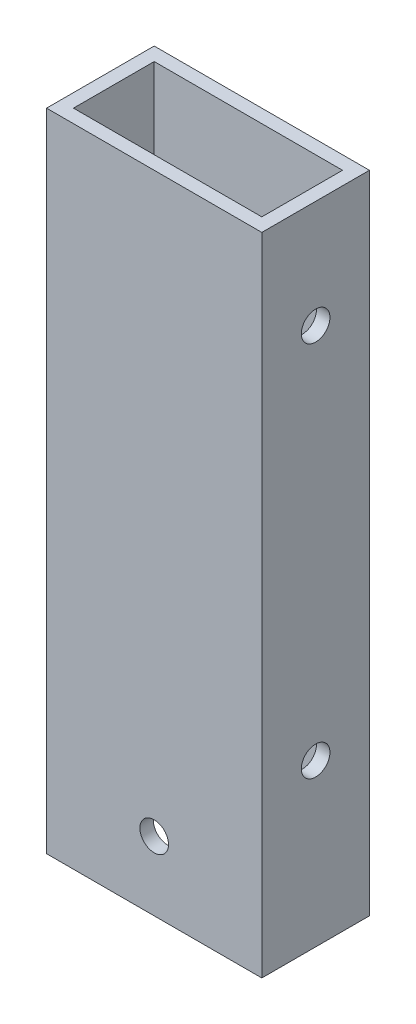
ISO-10303-21;
HEADER;
FILE_DESCRIPTION(('STEP AP214'),'2;1');
FILE_NAME('part.step','',(''),(''),'','','');
FILE_SCHEMA(('AUTOMOTIVE_DESIGN { 1 0 10303 214 1 1 1 1 }'));
ENDSEC;
DATA;
#1=APPLICATION_CONTEXT('core data for automotive mechanical design processes');
#2=APPLICATION_PROTOCOL_DEFINITION('international standard','automotive_design',2000,#1);
#3=PRODUCT_CONTEXT('',#1,'mechanical');
#4=PRODUCT('Part','Part','',(#3));
#5=PRODUCT_RELATED_PRODUCT_CATEGORY('part','',(#4));
#6=PRODUCT_DEFINITION_FORMATION('','',#4);
#7=PRODUCT_DEFINITION_CONTEXT('part definition',#1,'design');
#8=PRODUCT_DEFINITION('design','',#6,#7);
#9=PRODUCT_DEFINITION_SHAPE('','',#8);
#10=(LENGTH_UNIT() NAMED_UNIT(*) SI_UNIT(.MILLI.,.METRE.));
#11=(NAMED_UNIT(*) PLANE_ANGLE_UNIT() SI_UNIT($,.RADIAN.));
#12=(NAMED_UNIT(*) SI_UNIT($,.STERADIAN.) SOLID_ANGLE_UNIT());
#13=UNCERTAINTY_MEASURE_WITH_UNIT(LENGTH_MEASURE(1.E-05),#10,'distance_accuracy_value','');
#14=(GEOMETRIC_REPRESENTATION_CONTEXT(3) GLOBAL_UNCERTAINTY_ASSIGNED_CONTEXT((#13)) GLOBAL_UNIT_ASSIGNED_CONTEXT((#10,
#11,#12)) REPRESENTATION_CONTEXT('',''));
#15=CARTESIAN_POINT('',(0.,0.,0.));
#16=DIRECTION('',(0.,0.,1.));
#17=DIRECTION('',(1.,0.,0.));
#18=AXIS2_PLACEMENT_3D('',#15,#16,#17);
#19=CARTESIAN_POINT('',(0.,152.4,0.));
#20=DIRECTION('',(0.,-1.,0.));
#21=DIRECTION('',(0.,0.,-1.));
#22=AXIS2_PLACEMENT_3D('',#19,#20,#21);
#23=PLANE('',#22);
#24=DIRECTION('',(0.,0.,1.));
#25=VECTOR('',#24,1.);
#26=CARTESIAN_POINT('',(0.,152.4,0.));
#27=LINE('',#26,#25);
#28=CARTESIAN_POINT('',(0.,152.4,-25.4));
#29=VERTEX_POINT('',#28);
#30=CARTESIAN_POINT('',(0.,152.4,0.));
#31=VERTEX_POINT('',#30);
#32=EDGE_CURVE('E137',#29,#31,#27,.T.);
#33=ORIENTED_EDGE('',*,*,#32,.T.);
#34=DIRECTION('',(1.,0.,0.));
#35=VECTOR('',#34,1.);
#36=CARTESIAN_POINT('',(0.,152.4,0.));
#37=LINE('',#36,#35);
#38=CARTESIAN_POINT('',(50.8,152.4,0.));
#39=VERTEX_POINT('',#38);
#40=EDGE_CURVE('E140',#31,#39,#37,.T.);
#41=ORIENTED_EDGE('',*,*,#40,.T.);
#42=DIRECTION('',(0.,0.,-1.));
#43=VECTOR('',#42,1.);
#44=CARTESIAN_POINT('',(50.8,152.4,0.));
#45=LINE('',#44,#43);
#46=CARTESIAN_POINT('',(50.8,152.4,-25.4));
#47=VERTEX_POINT('',#46);
#48=EDGE_CURVE('E143',#39,#47,#45,.T.);
#49=ORIENTED_EDGE('',*,*,#48,.T.);
#50=DIRECTION('',(-1.,0.,0.));
#51=VECTOR('',#50,1.);
#52=CARTESIAN_POINT('',(0.,152.4,-25.4));
#53=LINE('',#52,#51);
#54=EDGE_CURVE('E145',#47,#29,#53,.T.);
#55=ORIENTED_EDGE('',*,*,#54,.T.);
#56=EDGE_LOOP('',(#33,#41,#49,#55));
#57=FACE_BOUND('',#56,.T.);
#58=DIRECTION('',(0.,0.,1.));
#59=VECTOR('',#58,1.);
#60=CARTESIAN_POINT('',(3.175,152.4,-3.175));
#61=LINE('',#60,#59);
#62=CARTESIAN_POINT('',(3.175,152.4,-22.225));
#63=VERTEX_POINT('',#62);
#64=CARTESIAN_POINT('',(3.175,152.4,-3.175));
#65=VERTEX_POINT('',#64);
#66=EDGE_CURVE('E99',#63,#65,#61,.T.);
#67=ORIENTED_EDGE('',*,*,#66,.F.);
#68=DIRECTION('',(-1.,0.,0.));
#69=VECTOR('',#68,1.);
#70=CARTESIAN_POINT('',(3.175,152.4,-22.225));
#71=LINE('',#70,#69);
#72=CARTESIAN_POINT('',(47.625,152.4,-22.225));
#73=VERTEX_POINT('',#72);
#74=EDGE_CURVE('E121',#73,#63,#71,.T.);
#75=ORIENTED_EDGE('',*,*,#74,.F.);
#76=DIRECTION('',(0.,0.,-1.));
#77=VECTOR('',#76,1.);
#78=CARTESIAN_POINT('',(47.625,152.4,-3.175));
#79=LINE('',#78,#77);
#80=CARTESIAN_POINT('',(47.625,152.4,-3.175));
#81=VERTEX_POINT('',#80);
#82=EDGE_CURVE('E119',#81,#73,#79,.T.);
#83=ORIENTED_EDGE('',*,*,#82,.F.);
#84=DIRECTION('',(1.,0.,0.));
#85=VECTOR('',#84,1.);
#86=CARTESIAN_POINT('',(3.175,152.4,-3.175));
#87=LINE('',#86,#85);
#88=EDGE_CURVE('E107',#65,#81,#87,.T.);
#89=ORIENTED_EDGE('',*,*,#88,.F.);
#90=EDGE_LOOP('',(#67,#75,#83,#89));
#91=FACE_BOUND('',#90,.T.);
#92=ADVANCED_FACE('F32',(#57,#91),#23,.F.);
#93=CARTESIAN_POINT('',(0.,0.,0.));
#94=DIRECTION('',(0.,-1.,0.));
#95=DIRECTION('',(0.,0.,-1.));
#96=AXIS2_PLACEMENT_3D('',#93,#94,#95);
#97=PLANE('',#96);
#98=DIRECTION('',(0.,0.,1.));
#99=VECTOR('',#98,1.);
#100=CARTESIAN_POINT('',(0.,0.,0.));
#101=LINE('',#100,#99);
#102=CARTESIAN_POINT('',(0.,0.,-25.4));
#103=VERTEX_POINT('',#102);
#104=CARTESIAN_POINT('',(0.,0.,0.));
#105=VERTEX_POINT('',#104);
#106=EDGE_CURVE('E115',#103,#105,#101,.T.);
#107=ORIENTED_EDGE('',*,*,#106,.F.);
#108=DIRECTION('',(-1.,0.,0.));
#109=VECTOR('',#108,1.);
#110=CARTESIAN_POINT('',(0.,0.,-25.4));
#111=LINE('',#110,#109);
#112=CARTESIAN_POINT('',(50.8,0.,-25.4));
#113=VERTEX_POINT('',#112);
#114=EDGE_CURVE('E141',#113,#103,#111,.T.);
#115=ORIENTED_EDGE('',*,*,#114,.F.);
#116=DIRECTION('',(0.,0.,-1.));
#117=VECTOR('',#116,1.);
#118=CARTESIAN_POINT('',(50.8,0.,0.));
#119=LINE('',#118,#117);
#120=CARTESIAN_POINT('',(50.8,0.,0.));
#121=VERTEX_POINT('',#120);
#122=EDGE_CURVE('E152',#121,#113,#119,.T.);
#123=ORIENTED_EDGE('',*,*,#122,.F.);
#124=DIRECTION('',(1.,0.,0.));
#125=VECTOR('',#124,1.);
#126=CARTESIAN_POINT('',(0.,0.,0.));
#127=LINE('',#126,#125);
#128=EDGE_CURVE('E150',#105,#121,#127,.T.);
#129=ORIENTED_EDGE('',*,*,#128,.F.);
#130=EDGE_LOOP('',(#107,#115,#123,#129));
#131=FACE_BOUND('',#130,.T.);
#132=DIRECTION('',(-1.,0.,0.));
#133=VECTOR('',#132,1.);
#134=CARTESIAN_POINT('',(3.175,0.,-22.225));
#135=LINE('',#134,#133);
#136=CARTESIAN_POINT('',(47.625,0.,-22.225));
#137=VERTEX_POINT('',#136);
#138=CARTESIAN_POINT('',(3.175,0.,-22.225));
#139=VERTEX_POINT('',#138);
#140=EDGE_CURVE('E108',#137,#139,#135,.T.);
#141=ORIENTED_EDGE('',*,*,#140,.T.);
#142=DIRECTION('',(0.,0.,1.));
#143=VECTOR('',#142,1.);
#144=CARTESIAN_POINT('',(3.175,0.,-3.175));
#145=LINE('',#144,#143);
#146=CARTESIAN_POINT('',(3.175,0.,-3.175));
#147=VERTEX_POINT('',#146);
#148=EDGE_CURVE('E57',#139,#147,#145,.T.);
#149=ORIENTED_EDGE('',*,*,#148,.T.);
#150=DIRECTION('',(1.,0.,0.));
#151=VECTOR('',#150,1.);
#152=CARTESIAN_POINT('',(3.175,0.,-3.175));
#153=LINE('',#152,#151);
#154=CARTESIAN_POINT('',(47.625,0.,-3.175));
#155=VERTEX_POINT('',#154);
#156=EDGE_CURVE('E114',#147,#155,#153,.T.);
#157=ORIENTED_EDGE('',*,*,#156,.T.);
#158=DIRECTION('',(0.,0.,-1.));
#159=VECTOR('',#158,1.);
#160=CARTESIAN_POINT('',(47.625,0.,-3.175));
#161=LINE('',#160,#159);
#162=EDGE_CURVE('E129',#155,#137,#161,.T.);
#163=ORIENTED_EDGE('',*,*,#162,.T.);
#164=EDGE_LOOP('',(#141,#149,#157,#163));
#165=FACE_BOUND('',#164,.T.);
#166=ADVANCED_FACE('F211',(#131,#165),#97,.T.);
#167=CARTESIAN_POINT('',(0.,152.4,0.));
#168=DIRECTION('',(1.,0.,0.));
#169=DIRECTION('',(0.,0.,-1.));
#170=AXIS2_PLACEMENT_3D('',#167,#168,#169);
#171=PLANE('',#170);
#172=CARTESIAN_POINT('',(0.,38.1,-12.7));
#173=DIRECTION('',(-1.,0.,0.));
#174=DIRECTION('',(0.,0.,1.));
#175=AXIS2_PLACEMENT_3D('',#172,#173,#174);
#176=CIRCLE('',#175,3.3782);
#177=CARTESIAN_POINT('',(0.,38.1,-9.3218));
#178=VERTEX_POINT('',#177);
#179=EDGE_CURVE('E175',#178,#178,#176,.T.);
#180=ORIENTED_EDGE('',*,*,#179,.F.);
#181=EDGE_LOOP('',(#180));
#182=FACE_BOUND('',#181,.T.);
#183=CARTESIAN_POINT('',(0.,127.,-12.7));
#184=DIRECTION('',(-1.,0.,0.));
#185=DIRECTION('',(0.,0.,1.));
#186=AXIS2_PLACEMENT_3D('',#183,#184,#185);
#187=CIRCLE('',#186,3.37819999999999);
#188=CARTESIAN_POINT('',(0.,127.,-9.3218));
#189=VERTEX_POINT('',#188);
#190=EDGE_CURVE('E172',#189,#189,#187,.T.);
#191=ORIENTED_EDGE('',*,*,#190,.F.);
#192=EDGE_LOOP('',(#191));
#193=FACE_BOUND('',#192,.T.);
#194=ORIENTED_EDGE('',*,*,#106,.T.);
#195=DIRECTION('',(0.,-1.,0.));
#196=VECTOR('',#195,1.);
#197=CARTESIAN_POINT('',(0.,152.4,0.));
#198=LINE('',#197,#196);
#199=EDGE_CURVE('E11',#31,#105,#198,.T.);
#200=ORIENTED_EDGE('',*,*,#199,.F.);
#201=ORIENTED_EDGE('',*,*,#32,.F.);
#202=DIRECTION('',(0.,-1.,0.));
#203=VECTOR('',#202,1.);
#204=CARTESIAN_POINT('',(0.,152.4,-25.4));
#205=LINE('',#204,#203);
#206=EDGE_CURVE('E147',#29,#103,#205,.T.);
#207=ORIENTED_EDGE('',*,*,#206,.T.);
#208=EDGE_LOOP('',(#194,#200,#201,#207));
#209=FACE_BOUND('',#208,.T.);
#210=ADVANCED_FACE('F34',(#182,#193,#209),#171,.F.);
#211=CARTESIAN_POINT('',(0.,152.4,0.));
#212=DIRECTION('',(0.,0.,-1.));
#213=DIRECTION('',(-1.,0.,0.));
#214=AXIS2_PLACEMENT_3D('',#211,#212,#213);
#215=PLANE('',#214);
#216=CARTESIAN_POINT('',(25.4000000000006,16.2686999999972,0.));
#217=DIRECTION('',(0.,0.,-1.));
#218=DIRECTION('',(-1.,0.,0.));
#219=AXIS2_PLACEMENT_3D('',#216,#217,#218);
#220=CIRCLE('',#219,3.3782);
#221=CARTESIAN_POINT('',(22.0218000000006,16.2686999999972,0.));
#222=VERTEX_POINT('',#221);
#223=EDGE_CURVE('E230',#222,#222,#220,.T.);
#224=ORIENTED_EDGE('',*,*,#223,.T.);
#225=EDGE_LOOP('',(#224));
#226=FACE_BOUND('',#225,.T.);
#227=ORIENTED_EDGE('',*,*,#128,.T.);
#228=DIRECTION('',(0.,-1.,0.));
#229=VECTOR('',#228,1.);
#230=CARTESIAN_POINT('',(50.8,152.4,0.));
#231=LINE('',#230,#229);
#232=EDGE_CURVE('E41',#39,#121,#231,.T.);
#233=ORIENTED_EDGE('',*,*,#232,.F.);
#234=ORIENTED_EDGE('',*,*,#40,.F.);
#235=ORIENTED_EDGE('',*,*,#199,.T.);
#236=EDGE_LOOP('',(#227,#233,#234,#235));
#237=FACE_BOUND('',#236,.T.);
#238=ADVANCED_FACE('F220',(#226,#237),#215,.F.);
#239=CARTESIAN_POINT('',(50.8,152.4,0.));
#240=DIRECTION('',(-1.,0.,0.));
#241=DIRECTION('',(0.,0.,1.));
#242=AXIS2_PLACEMENT_3D('',#239,#240,#241);
#243=PLANE('',#242);
#244=CARTESIAN_POINT('',(50.8,38.1,-12.7));
#245=DIRECTION('',(-1.,0.,0.));
#246=DIRECTION('',(0.,0.,1.));
#247=AXIS2_PLACEMENT_3D('',#244,#245,#246);
#248=CIRCLE('',#247,3.3782);
#249=CARTESIAN_POINT('',(50.8,38.1,-9.3218));
#250=VERTEX_POINT('',#249);
#251=EDGE_CURVE('E168',#250,#250,#248,.T.);
#252=ORIENTED_EDGE('',*,*,#251,.T.);
#253=EDGE_LOOP('',(#252));
#254=FACE_BOUND('',#253,.T.);
#255=CARTESIAN_POINT('',(50.8,127.,-12.7));
#256=DIRECTION('',(-1.,0.,0.));
#257=DIRECTION('',(0.,0.,1.));
#258=AXIS2_PLACEMENT_3D('',#255,#256,#257);
#259=CIRCLE('',#258,3.37819999999999);
#260=CARTESIAN_POINT('',(50.8,127.,-9.3218));
#261=VERTEX_POINT('',#260);
#262=EDGE_CURVE('E164',#261,#261,#259,.T.);
#263=ORIENTED_EDGE('',*,*,#262,.T.);
#264=EDGE_LOOP('',(#263));
#265=FACE_BOUND('',#264,.T.);
#266=ORIENTED_EDGE('',*,*,#122,.T.);
#267=DIRECTION('',(0.,-1.,0.));
#268=VECTOR('',#267,1.);
#269=CARTESIAN_POINT('',(50.8,152.4,-25.4));
#270=LINE('',#269,#268);
#271=EDGE_CURVE('E157',#47,#113,#270,.T.);
#272=ORIENTED_EDGE('',*,*,#271,.F.);
#273=ORIENTED_EDGE('',*,*,#48,.F.);
#274=ORIENTED_EDGE('',*,*,#232,.T.);
#275=EDGE_LOOP('',(#266,#272,#273,#274));
#276=FACE_BOUND('',#275,.T.);
#277=ADVANCED_FACE('F205',(#254,#265,#276),#243,.F.);
#278=CARTESIAN_POINT('',(0.,152.4,-25.4));
#279=DIRECTION('',(0.,0.,1.));
#280=DIRECTION('',(1.,0.,0.));
#281=AXIS2_PLACEMENT_3D('',#278,#279,#280);
#282=PLANE('',#281);
#283=CARTESIAN_POINT('',(25.4000000000006,16.2686999999972,-25.4));
#284=DIRECTION('',(0.,0.,-1.));
#285=DIRECTION('',(-1.,0.,0.));
#286=AXIS2_PLACEMENT_3D('',#283,#284,#285);
#287=CIRCLE('',#286,3.3782);
#288=CARTESIAN_POINT('',(22.0218000000006,16.2686999999972,-25.4));
#289=VERTEX_POINT('',#288);
#290=EDGE_CURVE('E279',#289,#289,#287,.T.);
#291=ORIENTED_EDGE('',*,*,#290,.F.);
#292=EDGE_LOOP('',(#291));
#293=FACE_BOUND('',#292,.T.);
#294=ORIENTED_EDGE('',*,*,#114,.T.);
#295=ORIENTED_EDGE('',*,*,#206,.F.);
#296=ORIENTED_EDGE('',*,*,#54,.F.);
#297=ORIENTED_EDGE('',*,*,#271,.T.);
#298=EDGE_LOOP('',(#294,#295,#296,#297));
#299=FACE_BOUND('',#298,.T.);
#300=ADVANCED_FACE('F195',(#293,#299),#282,.F.);
#301=CARTESIAN_POINT('',(3.175,152.4,-3.175));
#302=DIRECTION('',(1.,0.,0.));
#303=DIRECTION('',(0.,0.,-1.));
#304=AXIS2_PLACEMENT_3D('',#301,#302,#303);
#305=PLANE('',#304);
#306=CARTESIAN_POINT('',(3.175,38.1,-12.7));
#307=DIRECTION('',(1.,0.,0.));
#308=DIRECTION('',(0.,0.,-1.));
#309=AXIS2_PLACEMENT_3D('',#306,#307,#308);
#310=CIRCLE('',#309,3.3782);
#311=CARTESIAN_POINT('',(3.175,38.1,-16.0782));
#312=VERTEX_POINT('',#311);
#313=EDGE_CURVE('E167',#312,#312,#310,.T.);
#314=ORIENTED_EDGE('',*,*,#313,.F.);
#315=EDGE_LOOP('',(#314));
#316=FACE_BOUND('',#315,.T.);
#317=CARTESIAN_POINT('',(3.175,127.,-12.7));
#318=DIRECTION('',(1.,0.,0.));
#319=DIRECTION('',(0.,0.,-1.));
#320=AXIS2_PLACEMENT_3D('',#317,#318,#319);
#321=CIRCLE('',#320,3.37819999999999);
#322=CARTESIAN_POINT('',(3.175,127.,-16.0782));
#323=VERTEX_POINT('',#322);
#324=EDGE_CURVE('E127',#323,#323,#321,.T.);
#325=ORIENTED_EDGE('',*,*,#324,.F.);
#326=EDGE_LOOP('',(#325));
#327=FACE_BOUND('',#326,.T.);
#328=ORIENTED_EDGE('',*,*,#148,.F.);
#329=DIRECTION('',(0.,-1.,0.));
#330=VECTOR('',#329,1.);
#331=CARTESIAN_POINT('',(3.175,152.4,-22.225));
#332=LINE('',#331,#330);
#333=EDGE_CURVE('E103',#63,#139,#332,.T.);
#334=ORIENTED_EDGE('',*,*,#333,.F.);
#335=ORIENTED_EDGE('',*,*,#66,.T.);
#336=DIRECTION('',(0.,-1.,0.));
#337=VECTOR('',#336,1.);
#338=CARTESIAN_POINT('',(3.175,152.4,-3.175));
#339=LINE('',#338,#337);
#340=EDGE_CURVE('E102',#65,#147,#339,.T.);
#341=ORIENTED_EDGE('',*,*,#340,.T.);
#342=EDGE_LOOP('',(#328,#334,#335,#341));
#343=FACE_BOUND('',#342,.T.);
#344=ADVANCED_FACE('F101',(#316,#327,#343),#305,.T.);
#345=CARTESIAN_POINT('',(3.175,152.4,-3.175));
#346=DIRECTION('',(0.,0.,-1.));
#347=DIRECTION('',(-1.,0.,0.));
#348=AXIS2_PLACEMENT_3D('',#345,#346,#347);
#349=PLANE('',#348);
#350=CARTESIAN_POINT('',(25.4000000000006,16.2686999999972,-3.175));
#351=DIRECTION('',(0.,0.,-1.));
#352=DIRECTION('',(-1.,0.,0.));
#353=AXIS2_PLACEMENT_3D('',#350,#351,#352);
#354=CIRCLE('',#353,3.3782);
#355=CARTESIAN_POINT('',(22.0218000000006,16.2686999999972,-3.175));
#356=VERTEX_POINT('',#355);
#357=EDGE_CURVE('E180',#356,#356,#354,.T.);
#358=ORIENTED_EDGE('',*,*,#357,.F.);
#359=EDGE_LOOP('',(#358));
#360=FACE_BOUND('',#359,.T.);
#361=ORIENTED_EDGE('',*,*,#156,.F.);
#362=ORIENTED_EDGE('',*,*,#340,.F.);
#363=ORIENTED_EDGE('',*,*,#88,.T.);
#364=DIRECTION('',(0.,-1.,0.));
#365=VECTOR('',#364,1.);
#366=CARTESIAN_POINT('',(47.625,152.4,-3.175));
#367=LINE('',#366,#365);
#368=EDGE_CURVE('E116',#81,#155,#367,.T.);
#369=ORIENTED_EDGE('',*,*,#368,.T.);
#370=EDGE_LOOP('',(#361,#362,#363,#369));
#371=FACE_BOUND('',#370,.T.);
#372=ADVANCED_FACE('F111',(#360,#371),#349,.T.);
#373=CARTESIAN_POINT('',(47.625,152.4,-3.175));
#374=DIRECTION('',(-1.,0.,0.));
#375=DIRECTION('',(0.,0.,1.));
#376=AXIS2_PLACEMENT_3D('',#373,#374,#375);
#377=PLANE('',#376);
#378=CARTESIAN_POINT('',(47.625,38.1,-12.7));
#379=DIRECTION('',(-1.,0.,0.));
#380=DIRECTION('',(0.,0.,1.));
#381=AXIS2_PLACEMENT_3D('',#378,#379,#380);
#382=CIRCLE('',#381,3.3782);
#383=CARTESIAN_POINT('',(47.625,38.1,-9.3218));
#384=VERTEX_POINT('',#383);
#385=EDGE_CURVE('E165',#384,#384,#382,.T.);
#386=ORIENTED_EDGE('',*,*,#385,.F.);
#387=EDGE_LOOP('',(#386));
#388=FACE_BOUND('',#387,.T.);
#389=CARTESIAN_POINT('',(47.625,127.,-12.7));
#390=DIRECTION('',(-1.,0.,0.));
#391=DIRECTION('',(0.,0.,1.));
#392=AXIS2_PLACEMENT_3D('',#389,#390,#391);
#393=CIRCLE('',#392,3.37819999999999);
#394=CARTESIAN_POINT('',(47.625,127.,-9.3218));
#395=VERTEX_POINT('',#394);
#396=EDGE_CURVE('E162',#395,#395,#393,.T.);
#397=ORIENTED_EDGE('',*,*,#396,.F.);
#398=EDGE_LOOP('',(#397));
#399=FACE_BOUND('',#398,.T.);
#400=ORIENTED_EDGE('',*,*,#162,.F.);
#401=ORIENTED_EDGE('',*,*,#368,.F.);
#402=ORIENTED_EDGE('',*,*,#82,.T.);
#403=DIRECTION('',(0.,-1.,0.));
#404=VECTOR('',#403,1.);
#405=CARTESIAN_POINT('',(47.625,152.4,-22.225));
#406=LINE('',#405,#404);
#407=EDGE_CURVE('E49',#73,#137,#406,.T.);
#408=ORIENTED_EDGE('',*,*,#407,.T.);
#409=EDGE_LOOP('',(#400,#401,#402,#408));
#410=FACE_BOUND('',#409,.T.);
#411=ADVANCED_FACE('F202',(#388,#399,#410),#377,.T.);
#412=CARTESIAN_POINT('',(3.175,152.4,-22.225));
#413=DIRECTION('',(0.,0.,1.));
#414=DIRECTION('',(1.,0.,0.));
#415=AXIS2_PLACEMENT_3D('',#412,#413,#414);
#416=PLANE('',#415);
#417=CARTESIAN_POINT('',(25.4000000000006,16.2686999999972,-22.225));
#418=DIRECTION('',(0.,0.,1.));
#419=DIRECTION('',(1.,0.,0.));
#420=AXIS2_PLACEMENT_3D('',#417,#418,#419);
#421=CIRCLE('',#420,3.3782);
#422=CARTESIAN_POINT('',(28.7782000000006,16.2686999999972,-22.225));
#423=VERTEX_POINT('',#422);
#424=EDGE_CURVE('E36',#423,#423,#421,.T.);
#425=ORIENTED_EDGE('',*,*,#424,.F.);
#426=EDGE_LOOP('',(#425));
#427=FACE_BOUND('',#426,.T.);
#428=ORIENTED_EDGE('',*,*,#140,.F.);
#429=ORIENTED_EDGE('',*,*,#407,.F.);
#430=ORIENTED_EDGE('',*,*,#74,.T.);
#431=ORIENTED_EDGE('',*,*,#333,.T.);
#432=EDGE_LOOP('',(#428,#429,#430,#431));
#433=FACE_BOUND('',#432,.T.);
#434=ADVANCED_FACE('F246',(#427,#433),#416,.T.);
#435=CARTESIAN_POINT('',(50.8,127.,-12.7));
#436=DIRECTION('',(-1.,0.,0.));
#437=DIRECTION('',(0.,0.,1.));
#438=AXIS2_PLACEMENT_3D('',#435,#436,#437);
#439=CYLINDRICAL_SURFACE('',#438,3.37819999999999);
#440=ORIENTED_EDGE('',*,*,#396,.T.);
#441=EDGE_LOOP('',(#440));
#442=FACE_BOUND('',#441,.T.);
#443=ORIENTED_EDGE('',*,*,#262,.F.);
#444=EDGE_LOOP('',(#443));
#445=FACE_BOUND('',#444,.T.);
#446=ADVANCED_FACE('F248',(#442,#445),#439,.F.);
#447=ORIENTED_EDGE('',*,*,#324,.T.);
#448=EDGE_LOOP('',(#447));
#449=FACE_BOUND('',#448,.T.);
#450=ORIENTED_EDGE('',*,*,#190,.T.);
#451=EDGE_LOOP('',(#450));
#452=FACE_BOUND('',#451,.T.);
#453=ADVANCED_FACE('F191',(#449,#452),#439,.F.);
#454=CARTESIAN_POINT('',(50.8,38.1,-12.7));
#455=DIRECTION('',(-1.,0.,0.));
#456=DIRECTION('',(0.,0.,1.));
#457=AXIS2_PLACEMENT_3D('',#454,#455,#456);
#458=CYLINDRICAL_SURFACE('',#457,3.3782);
#459=ORIENTED_EDGE('',*,*,#385,.T.);
#460=EDGE_LOOP('',(#459));
#461=FACE_BOUND('',#460,.T.);
#462=ORIENTED_EDGE('',*,*,#251,.F.);
#463=EDGE_LOOP('',(#462));
#464=FACE_BOUND('',#463,.T.);
#465=ADVANCED_FACE('F261',(#461,#464),#458,.F.);
#466=ORIENTED_EDGE('',*,*,#313,.T.);
#467=EDGE_LOOP('',(#466));
#468=FACE_BOUND('',#467,.T.);
#469=ORIENTED_EDGE('',*,*,#179,.T.);
#470=EDGE_LOOP('',(#469));
#471=FACE_BOUND('',#470,.T.);
#472=ADVANCED_FACE('F264',(#468,#471),#458,.F.);
#473=CARTESIAN_POINT('',(25.4000000000006,16.2686999999972,0.));
#474=DIRECTION('',(0.,0.,-1.));
#475=DIRECTION('',(-1.,0.,0.));
#476=AXIS2_PLACEMENT_3D('',#473,#474,#475);
#477=CYLINDRICAL_SURFACE('',#476,3.3782);
#478=ORIENTED_EDGE('',*,*,#424,.T.);
#479=EDGE_LOOP('',(#478));
#480=FACE_BOUND('',#479,.T.);
#481=ORIENTED_EDGE('',*,*,#290,.T.);
#482=EDGE_LOOP('',(#481));
#483=FACE_BOUND('',#482,.T.);
#484=ADVANCED_FACE('F265',(#480,#483),#477,.F.);
#485=ORIENTED_EDGE('',*,*,#357,.T.);
#486=EDGE_LOOP('',(#485));
#487=FACE_BOUND('',#486,.T.);
#488=ORIENTED_EDGE('',*,*,#223,.F.);
#489=EDGE_LOOP('',(#488));
#490=FACE_BOUND('',#489,.T.);
#491=ADVANCED_FACE('F267',(#487,#490),#477,.F.);
#492=CLOSED_SHELL('',(#92,#166,#210,#238,#277,#300,#344,#372,#411,#434,#446,#453,#465,#472,#484,#491));
#493=MANIFOLD_SOLID_BREP('B2',#492);
#494=ADVANCED_BREP_SHAPE_REPRESENTATION('',(#18,#493),#14);
#495=SHAPE_DEFINITION_REPRESENTATION(#9,#494);
ENDSEC;
END-ISO-10303-21;
